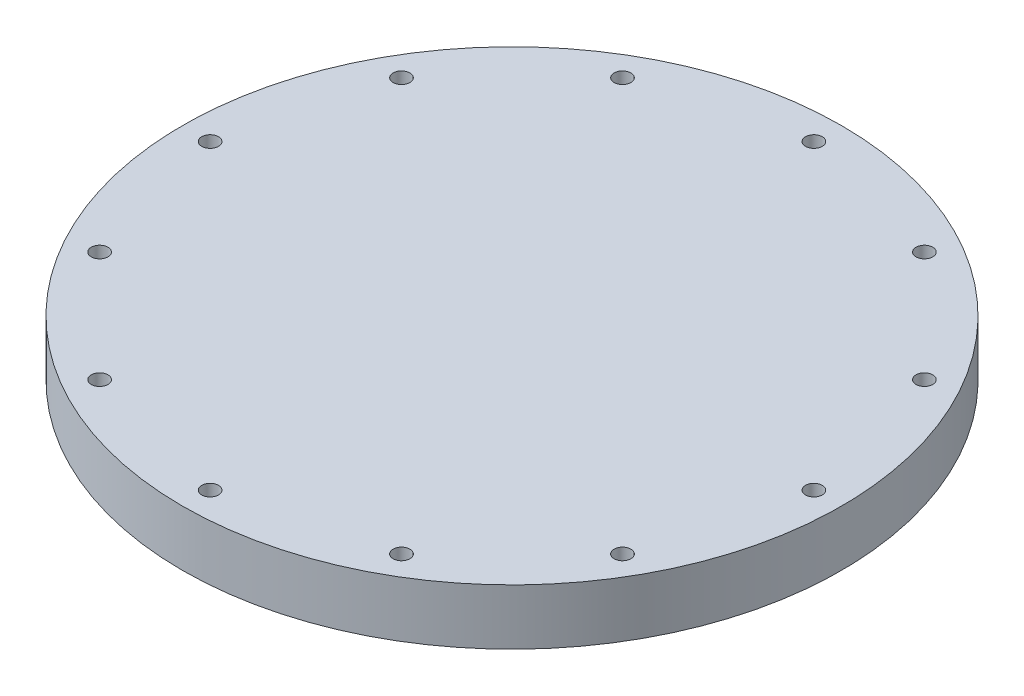
ISO-10303-21;
HEADER;
FILE_DESCRIPTION(('STEP AP214'),'2;1');
FILE_NAME('part.step','',(''),(''),'','','');
FILE_SCHEMA(('AUTOMOTIVE_DESIGN { 1 0 10303 214 1 1 1 1 }'));
ENDSEC;
DATA;
#1=APPLICATION_CONTEXT('core data for automotive mechanical design processes');
#2=APPLICATION_PROTOCOL_DEFINITION('international standard','automotive_design',2000,#1);
#3=PRODUCT_CONTEXT('',#1,'mechanical');
#4=PRODUCT('Part','Part','',(#3));
#5=PRODUCT_RELATED_PRODUCT_CATEGORY('part','',(#4));
#6=PRODUCT_DEFINITION_FORMATION('','',#4);
#7=PRODUCT_DEFINITION_CONTEXT('part definition',#1,'design');
#8=PRODUCT_DEFINITION('design','',#6,#7);
#9=PRODUCT_DEFINITION_SHAPE('','',#8);
#10=(LENGTH_UNIT() NAMED_UNIT(*) SI_UNIT(.MILLI.,.METRE.));
#11=(NAMED_UNIT(*) PLANE_ANGLE_UNIT() SI_UNIT($,.RADIAN.));
#12=(NAMED_UNIT(*) SI_UNIT($,.STERADIAN.) SOLID_ANGLE_UNIT());
#13=UNCERTAINTY_MEASURE_WITH_UNIT(LENGTH_MEASURE(1.E-05),#10,'distance_accuracy_value','');
#14=(GEOMETRIC_REPRESENTATION_CONTEXT(3) GLOBAL_UNCERTAINTY_ASSIGNED_CONTEXT((#13)) GLOBAL_UNIT_ASSIGNED_CONTEXT((#10,
#11,#12)) REPRESENTATION_CONTEXT('',''));
#15=CARTESIAN_POINT('',(0.,0.,0.));
#16=DIRECTION('',(0.,0.,1.));
#17=DIRECTION('',(1.,0.,0.));
#18=AXIS2_PLACEMENT_3D('',#15,#16,#17);
#19=CARTESIAN_POINT('',(0.,0.,0.));
#20=DIRECTION('',(0.,1.,0.));
#21=DIRECTION('',(0.,0.,1.));
#22=AXIS2_PLACEMENT_3D('',#19,#20,#21);
#23=PLANE('',#22);
#24=CARTESIAN_POINT('',(0.,0.,-51.6255));
#25=DIRECTION('',(0.,-1.,0.));
#26=DIRECTION('',(0.,0.,-1.));
#27=AXIS2_PLACEMENT_3D('',#24,#25,#26);
#28=CIRCLE('',#27,1.4351);
#29=CARTESIAN_POINT('',(0.,0.,-53.0606));
#30=VERTEX_POINT('',#29);
#31=EDGE_CURVE('E105',#30,#30,#28,.T.);
#32=ORIENTED_EDGE('',*,*,#31,.F.);
#33=EDGE_LOOP('',(#32));
#34=FACE_BOUND('',#33,.T.);
#35=CARTESIAN_POINT('',(-25.81275,0.,-44.7089944830735));
#36=DIRECTION('',(0.,-1.,0.));
#37=DIRECTION('',(0.,0.,-1.));
#38=AXIS2_PLACEMENT_3D('',#35,#36,#37);
#39=CIRCLE('',#38,1.4351);
#40=CARTESIAN_POINT('',(-25.81275,0.,-46.1440944830736));
#41=VERTEX_POINT('',#40);
#42=EDGE_CURVE('E99',#41,#41,#39,.T.);
#43=ORIENTED_EDGE('',*,*,#42,.F.);
#44=EDGE_LOOP('',(#43));
#45=FACE_BOUND('',#44,.T.);
#46=CARTESIAN_POINT('',(-44.7089944830735,0.,-25.81275));
#47=DIRECTION('',(0.,-1.,0.));
#48=DIRECTION('',(0.,0.,-1.));
#49=AXIS2_PLACEMENT_3D('',#46,#47,#48);
#50=CIRCLE('',#49,1.43509999999999);
#51=CARTESIAN_POINT('',(-44.7089944830735,0.,-27.24785));
#52=VERTEX_POINT('',#51);
#53=EDGE_CURVE('E93',#52,#52,#50,.T.);
#54=ORIENTED_EDGE('',*,*,#53,.F.);
#55=EDGE_LOOP('',(#54));
#56=FACE_BOUND('',#55,.T.);
#57=CARTESIAN_POINT('',(-51.6255,0.,0.));
#58=DIRECTION('',(0.,-1.,0.));
#59=DIRECTION('',(0.,0.,-1.));
#60=AXIS2_PLACEMENT_3D('',#57,#58,#59);
#61=CIRCLE('',#60,1.43509999999999);
#62=CARTESIAN_POINT('',(-51.6255,0.,-1.43509999999999));
#63=VERTEX_POINT('',#62);
#64=EDGE_CURVE('E87',#63,#63,#61,.T.);
#65=ORIENTED_EDGE('',*,*,#64,.F.);
#66=EDGE_LOOP('',(#65));
#67=FACE_BOUND('',#66,.T.);
#68=CARTESIAN_POINT('',(-44.7089944830735,0.,25.81275));
#69=DIRECTION('',(0.,-1.,0.));
#70=DIRECTION('',(0.,0.,-1.));
#71=AXIS2_PLACEMENT_3D('',#68,#69,#70);
#72=CIRCLE('',#71,1.4351);
#73=CARTESIAN_POINT('',(-44.7089944830735,0.,24.37765));
#74=VERTEX_POINT('',#73);
#75=EDGE_CURVE('E81',#74,#74,#72,.T.);
#76=ORIENTED_EDGE('',*,*,#75,.F.);
#77=EDGE_LOOP('',(#76));
#78=FACE_BOUND('',#77,.T.);
#79=CARTESIAN_POINT('',(-25.81275,0.,44.7089944830735));
#80=DIRECTION('',(0.,-1.,0.));
#81=DIRECTION('',(0.,0.,-1.));
#82=AXIS2_PLACEMENT_3D('',#79,#80,#81);
#83=CIRCLE('',#82,1.4351);
#84=CARTESIAN_POINT('',(-25.81275,0.,43.2738944830735));
#85=VERTEX_POINT('',#84);
#86=EDGE_CURVE('E75',#85,#85,#83,.T.);
#87=ORIENTED_EDGE('',*,*,#86,.F.);
#88=EDGE_LOOP('',(#87));
#89=FACE_BOUND('',#88,.T.);
#90=CARTESIAN_POINT('',(0.,0.,51.6255));
#91=DIRECTION('',(0.,-1.,0.));
#92=DIRECTION('',(0.,0.,-1.));
#93=AXIS2_PLACEMENT_3D('',#90,#91,#92);
#94=CIRCLE('',#93,1.4351);
#95=CARTESIAN_POINT('',(0.,0.,50.1904));
#96=VERTEX_POINT('',#95);
#97=EDGE_CURVE('E69',#96,#96,#94,.T.);
#98=ORIENTED_EDGE('',*,*,#97,.F.);
#99=EDGE_LOOP('',(#98));
#100=FACE_BOUND('',#99,.T.);
#101=CARTESIAN_POINT('',(25.81275,0.,44.7089944830735));
#102=DIRECTION('',(0.,-1.,0.));
#103=DIRECTION('',(0.,0.,-1.));
#104=AXIS2_PLACEMENT_3D('',#101,#102,#103);
#105=CIRCLE('',#104,1.4351);
#106=CARTESIAN_POINT('',(25.81275,0.,43.2738944830735));
#107=VERTEX_POINT('',#106);
#108=EDGE_CURVE('E63',#107,#107,#105,.T.);
#109=ORIENTED_EDGE('',*,*,#108,.F.);
#110=EDGE_LOOP('',(#109));
#111=FACE_BOUND('',#110,.T.);
#112=CARTESIAN_POINT('',(44.7089944830735,0.,25.81275));
#113=DIRECTION('',(0.,-1.,0.));
#114=DIRECTION('',(0.,0.,-1.));
#115=AXIS2_PLACEMENT_3D('',#112,#113,#114);
#116=CIRCLE('',#115,1.4351);
#117=CARTESIAN_POINT('',(44.7089944830735,0.,24.37765));
#118=VERTEX_POINT('',#117);
#119=EDGE_CURVE('E57',#118,#118,#116,.T.);
#120=ORIENTED_EDGE('',*,*,#119,.F.);
#121=EDGE_LOOP('',(#120));
#122=FACE_BOUND('',#121,.T.);
#123=CARTESIAN_POINT('',(51.6255,0.,0.));
#124=DIRECTION('',(0.,-1.,0.));
#125=DIRECTION('',(0.,0.,-1.));
#126=AXIS2_PLACEMENT_3D('',#123,#124,#125);
#127=CIRCLE('',#126,1.43509999999999);
#128=CARTESIAN_POINT('',(51.6255,0.,-1.43509999999999));
#129=VERTEX_POINT('',#128);
#130=EDGE_CURVE('E51',#129,#129,#127,.T.);
#131=ORIENTED_EDGE('',*,*,#130,.F.);
#132=EDGE_LOOP('',(#131));
#133=FACE_BOUND('',#132,.T.);
#134=CARTESIAN_POINT('',(0.,0.,0.));
#135=DIRECTION('',(0.,-1.,0.));
#136=DIRECTION('',(0.,0.,-1.));
#137=AXIS2_PLACEMENT_3D('',#134,#135,#136);
#138=CIRCLE('',#137,56.35625);
#139=CARTESIAN_POINT('',(0.,0.,-56.35625));
#140=VERTEX_POINT('',#139);
#141=EDGE_CURVE('E40',#140,#140,#138,.T.);
#142=ORIENTED_EDGE('',*,*,#141,.T.);
#143=EDGE_LOOP('',(#142));
#144=FACE_BOUND('',#143,.T.);
#145=CARTESIAN_POINT('',(25.81275,0.,-44.7089944830735));
#146=DIRECTION('',(0.,-1.,0.));
#147=DIRECTION('',(0.,0.,-1.));
#148=AXIS2_PLACEMENT_3D('',#145,#146,#147);
#149=CIRCLE('',#148,1.4351);
#150=CARTESIAN_POINT('',(25.81275,0.,-46.1440944830735));
#151=VERTEX_POINT('',#150);
#152=EDGE_CURVE('E111',#151,#151,#149,.T.);
#153=ORIENTED_EDGE('',*,*,#152,.F.);
#154=EDGE_LOOP('',(#153));
#155=FACE_BOUND('',#154,.T.);
#156=CARTESIAN_POINT('',(44.7089944830735,0.,-25.81275));
#157=DIRECTION('',(0.,-1.,0.));
#158=DIRECTION('',(0.,0.,-1.));
#159=AXIS2_PLACEMENT_3D('',#156,#157,#158);
#160=CIRCLE('',#159,1.4351);
#161=CARTESIAN_POINT('',(44.7089944830735,0.,-27.24785));
#162=VERTEX_POINT('',#161);
#163=EDGE_CURVE('E117',#162,#162,#160,.T.);
#164=ORIENTED_EDGE('',*,*,#163,.F.);
#165=EDGE_LOOP('',(#164));
#166=FACE_BOUND('',#165,.T.);
#167=ADVANCED_FACE('F37',(#34,#45,#56,#67,#78,#89,#100,#111,#122,#133,#144,#155,#166),#23,.F.);
#168=CARTESIAN_POINT('',(0.,9.525,0.));
#169=DIRECTION('',(0.,-1.,0.));
#170=DIRECTION('',(0.,0.,-1.));
#171=AXIS2_PLACEMENT_3D('',#168,#169,#170);
#172=CYLINDRICAL_SURFACE('',#171,56.35625);
#173=CARTESIAN_POINT('',(0.,9.525,0.));
#174=DIRECTION('',(0.,-1.,0.));
#175=DIRECTION('',(0.,0.,-1.));
#176=AXIS2_PLACEMENT_3D('',#173,#174,#175);
#177=CIRCLE('',#176,56.35625);
#178=CARTESIAN_POINT('',(0.,9.525,-56.35625));
#179=VERTEX_POINT('',#178);
#180=EDGE_CURVE('E10',#179,#179,#177,.T.);
#181=ORIENTED_EDGE('',*,*,#180,.T.);
#182=EDGE_LOOP('',(#181));
#183=FACE_BOUND('',#182,.T.);
#184=ORIENTED_EDGE('',*,*,#141,.F.);
#185=EDGE_LOOP('',(#184));
#186=FACE_BOUND('',#185,.T.);
#187=ADVANCED_FACE('F124',(#183,#186),#172,.T.);
#188=CARTESIAN_POINT('',(0.,9.525,0.));
#189=DIRECTION('',(0.,-1.,0.));
#190=DIRECTION('',(0.,0.,-1.));
#191=AXIS2_PLACEMENT_3D('',#188,#189,#190);
#192=PLANE('',#191);
#193=CARTESIAN_POINT('',(44.7089944830735,9.525,-25.81275));
#194=DIRECTION('',(0.,-1.,0.));
#195=DIRECTION('',(0.,0.,-1.));
#196=AXIS2_PLACEMENT_3D('',#193,#194,#195);
#197=CIRCLE('',#196,1.4351);
#198=CARTESIAN_POINT('',(44.7089944830735,9.525,-27.24785));
#199=VERTEX_POINT('',#198);
#200=EDGE_CURVE('E114',#199,#199,#197,.T.);
#201=ORIENTED_EDGE('',*,*,#200,.T.);
#202=EDGE_LOOP('',(#201));
#203=FACE_BOUND('',#202,.T.);
#204=CARTESIAN_POINT('',(44.7089944830735,9.525,25.81275));
#205=DIRECTION('',(0.,-1.,0.));
#206=DIRECTION('',(0.,0.,-1.));
#207=AXIS2_PLACEMENT_3D('',#204,#205,#206);
#208=CIRCLE('',#207,1.4351);
#209=CARTESIAN_POINT('',(44.7089944830735,9.525,24.37765));
#210=VERTEX_POINT('',#209);
#211=EDGE_CURVE('E54',#210,#210,#208,.T.);
#212=ORIENTED_EDGE('',*,*,#211,.T.);
#213=EDGE_LOOP('',(#212));
#214=FACE_BOUND('',#213,.T.);
#215=CARTESIAN_POINT('',(51.6255,9.525,0.));
#216=DIRECTION('',(0.,-1.,0.));
#217=DIRECTION('',(0.,0.,-1.));
#218=AXIS2_PLACEMENT_3D('',#215,#216,#217);
#219=CIRCLE('',#218,1.43509999999999);
#220=CARTESIAN_POINT('',(51.6255,9.525,-1.43509999999999));
#221=VERTEX_POINT('',#220);
#222=EDGE_CURVE('E47',#221,#221,#219,.T.);
#223=ORIENTED_EDGE('',*,*,#222,.T.);
#224=EDGE_LOOP('',(#223));
#225=FACE_BOUND('',#224,.T.);
#226=ORIENTED_EDGE('',*,*,#180,.F.);
#227=EDGE_LOOP('',(#226));
#228=FACE_BOUND('',#227,.T.);
#229=CARTESIAN_POINT('',(25.81275,9.525,-44.7089944830735));
#230=DIRECTION('',(0.,-1.,0.));
#231=DIRECTION('',(0.,0.,-1.));
#232=AXIS2_PLACEMENT_3D('',#229,#230,#231);
#233=CIRCLE('',#232,1.4351);
#234=CARTESIAN_POINT('',(25.81275,9.525,-46.1440944830735));
#235=VERTEX_POINT('',#234);
#236=EDGE_CURVE('E108',#235,#235,#233,.T.);
#237=ORIENTED_EDGE('',*,*,#236,.T.);
#238=EDGE_LOOP('',(#237));
#239=FACE_BOUND('',#238,.T.);
#240=CARTESIAN_POINT('',(0.,9.525,-51.6255));
#241=DIRECTION('',(0.,-1.,0.));
#242=DIRECTION('',(0.,0.,-1.));
#243=AXIS2_PLACEMENT_3D('',#240,#241,#242);
#244=CIRCLE('',#243,1.4351);
#245=CARTESIAN_POINT('',(0.,9.525,-53.0606));
#246=VERTEX_POINT('',#245);
#247=EDGE_CURVE('E102',#246,#246,#244,.T.);
#248=ORIENTED_EDGE('',*,*,#247,.T.);
#249=EDGE_LOOP('',(#248));
#250=FACE_BOUND('',#249,.T.);
#251=CARTESIAN_POINT('',(-25.81275,9.525,-44.7089944830735));
#252=DIRECTION('',(0.,-1.,0.));
#253=DIRECTION('',(0.,0.,-1.));
#254=AXIS2_PLACEMENT_3D('',#251,#252,#253);
#255=CIRCLE('',#254,1.4351);
#256=CARTESIAN_POINT('',(-25.81275,9.525,-46.1440944830736));
#257=VERTEX_POINT('',#256);
#258=EDGE_CURVE('E96',#257,#257,#255,.T.);
#259=ORIENTED_EDGE('',*,*,#258,.T.);
#260=EDGE_LOOP('',(#259));
#261=FACE_BOUND('',#260,.T.);
#262=CARTESIAN_POINT('',(-25.81275,9.525,44.7089944830735));
#263=DIRECTION('',(0.,-1.,0.));
#264=DIRECTION('',(0.,0.,-1.));
#265=AXIS2_PLACEMENT_3D('',#262,#263,#264);
#266=CIRCLE('',#265,1.4351);
#267=CARTESIAN_POINT('',(-25.81275,9.525,43.2738944830735));
#268=VERTEX_POINT('',#267);
#269=EDGE_CURVE('E72',#268,#268,#266,.T.);
#270=ORIENTED_EDGE('',*,*,#269,.T.);
#271=EDGE_LOOP('',(#270));
#272=FACE_BOUND('',#271,.T.);
#273=CARTESIAN_POINT('',(0.,9.525,51.6255));
#274=DIRECTION('',(0.,-1.,0.));
#275=DIRECTION('',(0.,0.,-1.));
#276=AXIS2_PLACEMENT_3D('',#273,#274,#275);
#277=CIRCLE('',#276,1.4351);
#278=CARTESIAN_POINT('',(0.,9.525,50.1904));
#279=VERTEX_POINT('',#278);
#280=EDGE_CURVE('E66',#279,#279,#277,.T.);
#281=ORIENTED_EDGE('',*,*,#280,.T.);
#282=EDGE_LOOP('',(#281));
#283=FACE_BOUND('',#282,.T.);
#284=CARTESIAN_POINT('',(25.81275,9.525,44.7089944830735));
#285=DIRECTION('',(0.,-1.,0.));
#286=DIRECTION('',(0.,0.,-1.));
#287=AXIS2_PLACEMENT_3D('',#284,#285,#286);
#288=CIRCLE('',#287,1.4351);
#289=CARTESIAN_POINT('',(25.81275,9.525,43.2738944830735));
#290=VERTEX_POINT('',#289);
#291=EDGE_CURVE('E60',#290,#290,#288,.T.);
#292=ORIENTED_EDGE('',*,*,#291,.T.);
#293=EDGE_LOOP('',(#292));
#294=FACE_BOUND('',#293,.T.);
#295=CARTESIAN_POINT('',(-44.7089944830735,9.525,25.81275));
#296=DIRECTION('',(0.,-1.,0.));
#297=DIRECTION('',(0.,0.,-1.));
#298=AXIS2_PLACEMENT_3D('',#295,#296,#297);
#299=CIRCLE('',#298,1.4351);
#300=CARTESIAN_POINT('',(-44.7089944830735,9.525,24.37765));
#301=VERTEX_POINT('',#300);
#302=EDGE_CURVE('E78',#301,#301,#299,.T.);
#303=ORIENTED_EDGE('',*,*,#302,.T.);
#304=EDGE_LOOP('',(#303));
#305=FACE_BOUND('',#304,.T.);
#306=CARTESIAN_POINT('',(-51.6255,9.525,0.));
#307=DIRECTION('',(0.,-1.,0.));
#308=DIRECTION('',(0.,0.,-1.));
#309=AXIS2_PLACEMENT_3D('',#306,#307,#308);
#310=CIRCLE('',#309,1.43509999999999);
#311=CARTESIAN_POINT('',(-51.6255,9.525,-1.43509999999999));
#312=VERTEX_POINT('',#311);
#313=EDGE_CURVE('E84',#312,#312,#310,.T.);
#314=ORIENTED_EDGE('',*,*,#313,.T.);
#315=EDGE_LOOP('',(#314));
#316=FACE_BOUND('',#315,.T.);
#317=CARTESIAN_POINT('',(-44.7089944830735,9.525,-25.81275));
#318=DIRECTION('',(0.,-1.,0.));
#319=DIRECTION('',(0.,0.,-1.));
#320=AXIS2_PLACEMENT_3D('',#317,#318,#319);
#321=CIRCLE('',#320,1.43509999999999);
#322=CARTESIAN_POINT('',(-44.7089944830735,9.525,-27.24785));
#323=VERTEX_POINT('',#322);
#324=EDGE_CURVE('E90',#323,#323,#321,.T.);
#325=ORIENTED_EDGE('',*,*,#324,.T.);
#326=EDGE_LOOP('',(#325));
#327=FACE_BOUND('',#326,.T.);
#328=ADVANCED_FACE('F129',(#203,#214,#225,#228,#239,#250,#261,#272,#283,#294,#305,#316,#327),
#192,.F.);
#329=CARTESIAN_POINT('',(51.6255,0.,0.));
#330=DIRECTION('',(0.,-1.,0.));
#331=DIRECTION('',(0.,0.,-1.));
#332=AXIS2_PLACEMENT_3D('',#329,#330,#331);
#333=CYLINDRICAL_SURFACE('',#332,1.43509999999999);
#334=ORIENTED_EDGE('',*,*,#222,.F.);
#335=EDGE_LOOP('',(#334));
#336=FACE_BOUND('',#335,.T.);
#337=ORIENTED_EDGE('',*,*,#130,.T.);
#338=EDGE_LOOP('',(#337));
#339=FACE_BOUND('',#338,.T.);
#340=ADVANCED_FACE('F200',(#336,#339),#333,.F.);
#341=CARTESIAN_POINT('',(44.7089944830735,0.,25.81275));
#342=DIRECTION('',(0.,-1.,0.));
#343=DIRECTION('',(0.,0.,-1.));
#344=AXIS2_PLACEMENT_3D('',#341,#342,#343);
#345=CYLINDRICAL_SURFACE('',#344,1.4351);
#346=ORIENTED_EDGE('',*,*,#211,.F.);
#347=EDGE_LOOP('',(#346));
#348=FACE_BOUND('',#347,.T.);
#349=ORIENTED_EDGE('',*,*,#119,.T.);
#350=EDGE_LOOP('',(#349));
#351=FACE_BOUND('',#350,.T.);
#352=ADVANCED_FACE('F196',(#348,#351),#345,.F.);
#353=CARTESIAN_POINT('',(25.81275,0.,44.7089944830735));
#354=DIRECTION('',(0.,-1.,0.));
#355=DIRECTION('',(0.,0.,-1.));
#356=AXIS2_PLACEMENT_3D('',#353,#354,#355);
#357=CYLINDRICAL_SURFACE('',#356,1.4351);
#358=ORIENTED_EDGE('',*,*,#291,.F.);
#359=EDGE_LOOP('',(#358));
#360=FACE_BOUND('',#359,.T.);
#361=ORIENTED_EDGE('',*,*,#108,.T.);
#362=EDGE_LOOP('',(#361));
#363=FACE_BOUND('',#362,.T.);
#364=ADVANCED_FACE('F192',(#360,#363),#357,.F.);
#365=CARTESIAN_POINT('',(0.,0.,51.6255));
#366=DIRECTION('',(0.,-1.,0.));
#367=DIRECTION('',(0.,0.,-1.));
#368=AXIS2_PLACEMENT_3D('',#365,#366,#367);
#369=CYLINDRICAL_SURFACE('',#368,1.4351);
#370=ORIENTED_EDGE('',*,*,#280,.F.);
#371=EDGE_LOOP('',(#370));
#372=FACE_BOUND('',#371,.T.);
#373=ORIENTED_EDGE('',*,*,#97,.T.);
#374=EDGE_LOOP('',(#373));
#375=FACE_BOUND('',#374,.T.);
#376=ADVANCED_FACE('F188',(#372,#375),#369,.F.);
#377=CARTESIAN_POINT('',(-25.81275,0.,44.7089944830735));
#378=DIRECTION('',(0.,-1.,0.));
#379=DIRECTION('',(0.,0.,-1.));
#380=AXIS2_PLACEMENT_3D('',#377,#378,#379);
#381=CYLINDRICAL_SURFACE('',#380,1.4351);
#382=ORIENTED_EDGE('',*,*,#269,.F.);
#383=EDGE_LOOP('',(#382));
#384=FACE_BOUND('',#383,.T.);
#385=ORIENTED_EDGE('',*,*,#86,.T.);
#386=EDGE_LOOP('',(#385));
#387=FACE_BOUND('',#386,.T.);
#388=ADVANCED_FACE('F184',(#384,#387),#381,.F.);
#389=CARTESIAN_POINT('',(-44.7089944830735,0.,25.81275));
#390=DIRECTION('',(0.,-1.,0.));
#391=DIRECTION('',(0.,0.,-1.));
#392=AXIS2_PLACEMENT_3D('',#389,#390,#391);
#393=CYLINDRICAL_SURFACE('',#392,1.4351);
#394=ORIENTED_EDGE('',*,*,#302,.F.);
#395=EDGE_LOOP('',(#394));
#396=FACE_BOUND('',#395,.T.);
#397=ORIENTED_EDGE('',*,*,#75,.T.);
#398=EDGE_LOOP('',(#397));
#399=FACE_BOUND('',#398,.T.);
#400=ADVANCED_FACE('F180',(#396,#399),#393,.F.);
#401=CARTESIAN_POINT('',(-51.6255,0.,0.));
#402=DIRECTION('',(0.,-1.,0.));
#403=DIRECTION('',(0.,0.,-1.));
#404=AXIS2_PLACEMENT_3D('',#401,#402,#403);
#405=CYLINDRICAL_SURFACE('',#404,1.43509999999999);
#406=ORIENTED_EDGE('',*,*,#313,.F.);
#407=EDGE_LOOP('',(#406));
#408=FACE_BOUND('',#407,.T.);
#409=ORIENTED_EDGE('',*,*,#64,.T.);
#410=EDGE_LOOP('',(#409));
#411=FACE_BOUND('',#410,.T.);
#412=ADVANCED_FACE('F176',(#408,#411),#405,.F.);
#413=CARTESIAN_POINT('',(-44.7089944830735,0.,-25.81275));
#414=DIRECTION('',(0.,-1.,0.));
#415=DIRECTION('',(0.,0.,-1.));
#416=AXIS2_PLACEMENT_3D('',#413,#414,#415);
#417=CYLINDRICAL_SURFACE('',#416,1.43509999999999);
#418=ORIENTED_EDGE('',*,*,#324,.F.);
#419=EDGE_LOOP('',(#418));
#420=FACE_BOUND('',#419,.T.);
#421=ORIENTED_EDGE('',*,*,#53,.T.);
#422=EDGE_LOOP('',(#421));
#423=FACE_BOUND('',#422,.T.);
#424=ADVANCED_FACE('F172',(#420,#423),#417,.F.);
#425=CARTESIAN_POINT('',(-25.81275,0.,-44.7089944830735));
#426=DIRECTION('',(0.,-1.,0.));
#427=DIRECTION('',(0.,0.,-1.));
#428=AXIS2_PLACEMENT_3D('',#425,#426,#427);
#429=CYLINDRICAL_SURFACE('',#428,1.4351);
#430=ORIENTED_EDGE('',*,*,#258,.F.);
#431=EDGE_LOOP('',(#430));
#432=FACE_BOUND('',#431,.T.);
#433=ORIENTED_EDGE('',*,*,#42,.T.);
#434=EDGE_LOOP('',(#433));
#435=FACE_BOUND('',#434,.T.);
#436=ADVANCED_FACE('F165',(#432,#435),#429,.F.);
#437=CARTESIAN_POINT('',(0.,0.,-51.6255));
#438=DIRECTION('',(0.,-1.,0.));
#439=DIRECTION('',(0.,0.,-1.));
#440=AXIS2_PLACEMENT_3D('',#437,#438,#439);
#441=CYLINDRICAL_SURFACE('',#440,1.4351);
#442=ORIENTED_EDGE('',*,*,#247,.F.);
#443=EDGE_LOOP('',(#442));
#444=FACE_BOUND('',#443,.T.);
#445=ORIENTED_EDGE('',*,*,#31,.T.);
#446=EDGE_LOOP('',(#445));
#447=FACE_BOUND('',#446,.T.);
#448=ADVANCED_FACE('F156',(#444,#447),#441,.F.);
#449=CARTESIAN_POINT('',(25.81275,0.,-44.7089944830735));
#450=DIRECTION('',(0.,-1.,0.));
#451=DIRECTION('',(0.,0.,-1.));
#452=AXIS2_PLACEMENT_3D('',#449,#450,#451);
#453=CYLINDRICAL_SURFACE('',#452,1.4351);
#454=ORIENTED_EDGE('',*,*,#236,.F.);
#455=EDGE_LOOP('',(#454));
#456=FACE_BOUND('',#455,.T.);
#457=ORIENTED_EDGE('',*,*,#152,.T.);
#458=EDGE_LOOP('',(#457));
#459=FACE_BOUND('',#458,.T.);
#460=ADVANCED_FACE('F154',(#456,#459),#453,.F.);
#461=CARTESIAN_POINT('',(44.7089944830735,0.,-25.81275));
#462=DIRECTION('',(0.,-1.,0.));
#463=DIRECTION('',(0.,0.,-1.));
#464=AXIS2_PLACEMENT_3D('',#461,#462,#463);
#465=CYLINDRICAL_SURFACE('',#464,1.4351);
#466=ORIENTED_EDGE('',*,*,#200,.F.);
#467=EDGE_LOOP('',(#466));
#468=FACE_BOUND('',#467,.T.);
#469=ORIENTED_EDGE('',*,*,#163,.T.);
#470=EDGE_LOOP('',(#469));
#471=FACE_BOUND('',#470,.T.);
#472=ADVANCED_FACE('F121',(#468,#471),#465,.F.);
#473=CLOSED_SHELL('',(#167,#187,#328,#340,#352,#364,#376,#388,#400,#412,#424,#436,#448,#460,#472));
#474=MANIFOLD_SOLID_BREP('B2',#473);
#475=ADVANCED_BREP_SHAPE_REPRESENTATION('',(#18,#474),#14);
#476=SHAPE_DEFINITION_REPRESENTATION(#9,#475);
ENDSEC;
END-ISO-10303-21;
